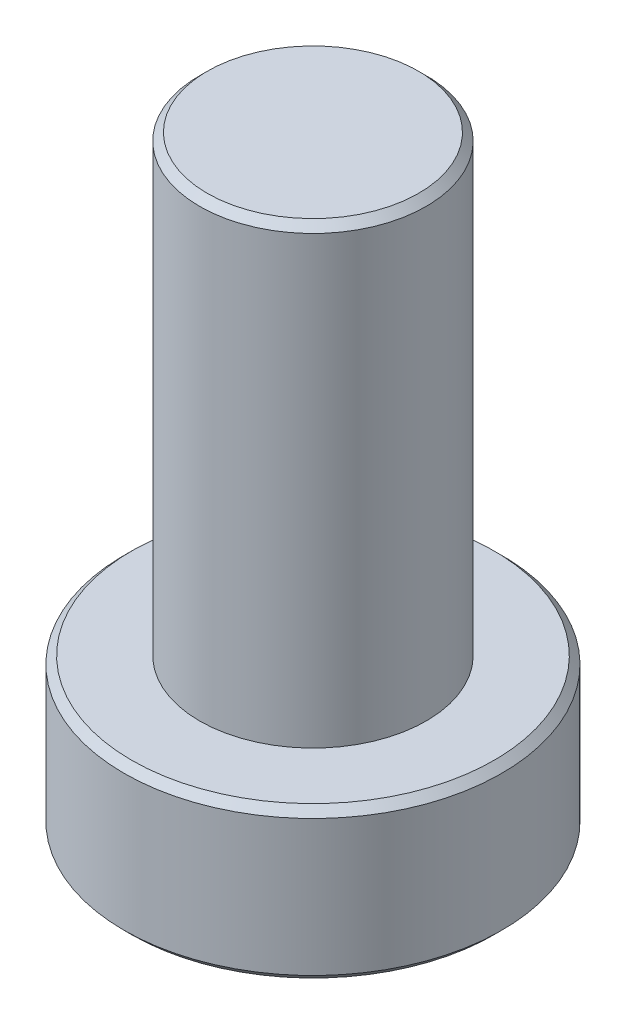
ISO-10303-21;
HEADER;
FILE_DESCRIPTION(('STEP AP214'),'2;1');
FILE_NAME('part.step','',(''),(''),'','','');
FILE_SCHEMA(('AUTOMOTIVE_DESIGN { 1 0 10303 214 1 1 1 1 }'));
ENDSEC;
DATA;
#1=APPLICATION_CONTEXT('core data for automotive mechanical design processes');
#2=APPLICATION_PROTOCOL_DEFINITION('international standard','automotive_design',2000,#1);
#3=PRODUCT_CONTEXT('',#1,'mechanical');
#4=PRODUCT('Part','Part','',(#3));
#5=PRODUCT_RELATED_PRODUCT_CATEGORY('part','',(#4));
#6=PRODUCT_DEFINITION_FORMATION('','',#4);
#7=PRODUCT_DEFINITION_CONTEXT('part definition',#1,'design');
#8=PRODUCT_DEFINITION('design','',#6,#7);
#9=PRODUCT_DEFINITION_SHAPE('','',#8);
#10=(LENGTH_UNIT() NAMED_UNIT(*) SI_UNIT(.MILLI.,.METRE.));
#11=(NAMED_UNIT(*) PLANE_ANGLE_UNIT() SI_UNIT($,.RADIAN.));
#12=(NAMED_UNIT(*) SI_UNIT($,.STERADIAN.) SOLID_ANGLE_UNIT());
#13=UNCERTAINTY_MEASURE_WITH_UNIT(LENGTH_MEASURE(1.E-05),#10,'distance_accuracy_value','');
#14=(GEOMETRIC_REPRESENTATION_CONTEXT(3) GLOBAL_UNCERTAINTY_ASSIGNED_CONTEXT((#13)) GLOBAL_UNIT_ASSIGNED_CONTEXT((#10,
#11,#12)) REPRESENTATION_CONTEXT('',''));
#15=CARTESIAN_POINT('',(0.,0.,0.));
#16=DIRECTION('',(0.,0.,1.));
#17=DIRECTION('',(1.,0.,0.));
#18=AXIS2_PLACEMENT_3D('',#15,#16,#17);
#19=CARTESIAN_POINT('',(0.,4.,0.));
#20=DIRECTION('',(0.,-1.,0.));
#21=DIRECTION('',(0.,0.,-1.));
#22=AXIS2_PLACEMENT_3D('',#19,#20,#21);
#23=CYLINDRICAL_SURFACE('',#22,5.);
#24=CARTESIAN_POINT('',(0.,0.199999999999998,0.));
#25=DIRECTION('',(0.,1.,0.));
#26=DIRECTION('',(0.,0.,1.));
#27=AXIS2_PLACEMENT_3D('',#24,#25,#26);
#28=CIRCLE('',#27,5.);
#29=CARTESIAN_POINT('',(0.,0.199999999999998,5.));
#30=VERTEX_POINT('',#29);
#31=EDGE_CURVE('E53',#30,#30,#28,.T.);
#32=ORIENTED_EDGE('',*,*,#31,.T.);
#33=EDGE_LOOP('',(#32));
#34=FACE_BOUND('',#33,.T.);
#35=CARTESIAN_POINT('',(0.,3.8,0.));
#36=DIRECTION('',(0.,1.,0.));
#37=DIRECTION('',(0.,0.,1.));
#38=AXIS2_PLACEMENT_3D('',#35,#36,#37);
#39=CIRCLE('',#38,5.);
#40=CARTESIAN_POINT('',(0.,3.8,5.));
#41=VERTEX_POINT('',#40);
#42=EDGE_CURVE('E56',#41,#41,#39,.F.);
#43=ORIENTED_EDGE('',*,*,#42,.T.);
#44=EDGE_LOOP('',(#43));
#45=FACE_BOUND('',#44,.T.);
#46=ADVANCED_FACE('F33',(#34,#45),#23,.T.);
#47=CARTESIAN_POINT('',(0.,4.,0.));
#48=DIRECTION('',(0.,1.,0.));
#49=DIRECTION('',(0.,0.,1.));
#50=AXIS2_PLACEMENT_3D('',#47,#48,#49);
#51=PLANE('',#50);
#52=CARTESIAN_POINT('',(0.,4.,0.));
#53=DIRECTION('',(0.,1.,0.));
#54=DIRECTION('',(0.,0.,1.));
#55=AXIS2_PLACEMENT_3D('',#52,#53,#54);
#56=CIRCLE('',#55,4.8);
#57=CARTESIAN_POINT('',(0.,4.,4.8));
#58=VERTEX_POINT('',#57);
#59=EDGE_CURVE('E44',#58,#58,#56,.T.);
#60=ORIENTED_EDGE('',*,*,#59,.T.);
#61=EDGE_LOOP('',(#60));
#62=FACE_BOUND('',#61,.T.);
#63=CARTESIAN_POINT('',(0.,4.,0.));
#64=DIRECTION('',(0.,1.,0.));
#65=DIRECTION('',(0.,0.,1.));
#66=AXIS2_PLACEMENT_3D('',#63,#64,#65);
#67=CIRCLE('',#66,3.);
#68=CARTESIAN_POINT('',(0.,4.,3.));
#69=VERTEX_POINT('',#68);
#70=EDGE_CURVE('E59',#69,#69,#67,.T.);
#71=ORIENTED_EDGE('',*,*,#70,.F.);
#72=EDGE_LOOP('',(#71));
#73=FACE_BOUND('',#72,.T.);
#74=ADVANCED_FACE('F65',(#62,#73),#51,.T.);
#75=CARTESIAN_POINT('',(0.,0.,0.));
#76=DIRECTION('',(0.,1.,0.));
#77=DIRECTION('',(0.,0.,1.));
#78=AXIS2_PLACEMENT_3D('',#75,#76,#77);
#79=PLANE('',#78);
#80=CARTESIAN_POINT('',(0.,0.,0.));
#81=DIRECTION('',(0.,1.,0.));
#82=DIRECTION('',(0.,0.,1.));
#83=AXIS2_PLACEMENT_3D('',#80,#81,#82);
#84=CIRCLE('',#83,4.8);
#85=CARTESIAN_POINT('',(0.,0.,4.8));
#86=VERTEX_POINT('',#85);
#87=EDGE_CURVE('E48',#86,#86,#84,.F.);
#88=ORIENTED_EDGE('',*,*,#87,.T.);
#89=EDGE_LOOP('',(#88));
#90=FACE_BOUND('',#89,.T.);
#91=ADVANCED_FACE('F67',(#90),#79,.F.);
#92=CARTESIAN_POINT('',(0.,16.,0.));
#93=DIRECTION('',(0.,-1.,0.));
#94=DIRECTION('',(0.,0.,-1.));
#95=AXIS2_PLACEMENT_3D('',#92,#93,#94);
#96=CYLINDRICAL_SURFACE('',#95,3.);
#97=CARTESIAN_POINT('',(0.,15.8,0.));
#98=DIRECTION('',(0.,1.,0.));
#99=DIRECTION('',(0.,0.,1.));
#100=AXIS2_PLACEMENT_3D('',#97,#98,#99);
#101=CIRCLE('',#100,3.);
#102=CARTESIAN_POINT('',(0.,15.8,3.));
#103=VERTEX_POINT('',#102);
#104=EDGE_CURVE('E10',#103,#103,#101,.F.);
#105=ORIENTED_EDGE('',*,*,#104,.T.);
#106=EDGE_LOOP('',(#105));
#107=FACE_BOUND('',#106,.T.);
#108=ORIENTED_EDGE('',*,*,#70,.T.);
#109=EDGE_LOOP('',(#108));
#110=FACE_BOUND('',#109,.T.);
#111=ADVANCED_FACE('F63',(#107,#110),#96,.T.);
#112=CARTESIAN_POINT('',(0.,16.,0.));
#113=DIRECTION('',(0.,1.,0.));
#114=DIRECTION('',(0.,0.,1.));
#115=AXIS2_PLACEMENT_3D('',#112,#113,#114);
#116=PLANE('',#115);
#117=CARTESIAN_POINT('',(0.,16.,0.));
#118=DIRECTION('',(0.,1.,0.));
#119=DIRECTION('',(0.,0.,1.));
#120=AXIS2_PLACEMENT_3D('',#117,#118,#119);
#121=CIRCLE('',#120,2.8);
#122=CARTESIAN_POINT('',(0.,16.,2.8));
#123=VERTEX_POINT('',#122);
#124=EDGE_CURVE('E40',#123,#123,#121,.T.);
#125=ORIENTED_EDGE('',*,*,#124,.T.);
#126=EDGE_LOOP('',(#125));
#127=FACE_BOUND('',#126,.T.);
#128=ADVANCED_FACE('F84',(#127),#116,.T.);
#129=CARTESIAN_POINT('',(0.,0.199999999999998,0.));
#130=DIRECTION('',(0.,1.,0.));
#131=DIRECTION('',(0.,0.,1.));
#132=AXIS2_PLACEMENT_3D('',#129,#130,#131);
#133=CONICAL_SURFACE('',#132,5.,0.785398163397448);
#134=ORIENTED_EDGE('',*,*,#87,.F.);
#135=EDGE_LOOP('',(#134));
#136=FACE_BOUND('',#135,.T.);
#137=ORIENTED_EDGE('',*,*,#31,.F.);
#138=EDGE_LOOP('',(#137));
#139=FACE_BOUND('',#138,.T.);
#140=ADVANCED_FACE('F81',(#136,#139),#133,.T.);
#141=CARTESIAN_POINT('',(0.,4.,0.));
#142=DIRECTION('',(0.,-1.,0.));
#143=DIRECTION('',(0.,0.,-1.));
#144=AXIS2_PLACEMENT_3D('',#141,#142,#143);
#145=CONICAL_SURFACE('',#144,4.8,0.785398163397446);
#146=ORIENTED_EDGE('',*,*,#42,.F.);
#147=EDGE_LOOP('',(#146));
#148=FACE_BOUND('',#147,.T.);
#149=ORIENTED_EDGE('',*,*,#59,.F.);
#150=EDGE_LOOP('',(#149));
#151=FACE_BOUND('',#150,.T.);
#152=ADVANCED_FACE('F83',(#148,#151),#145,.T.);
#153=CARTESIAN_POINT('',(0.,16.,0.));
#154=DIRECTION('',(0.,-1.,0.));
#155=DIRECTION('',(0.,0.,-1.));
#156=AXIS2_PLACEMENT_3D('',#153,#154,#155);
#157=CONICAL_SURFACE('',#156,2.8,0.785398163397453);
#158=ORIENTED_EDGE('',*,*,#104,.F.);
#159=EDGE_LOOP('',(#158));
#160=FACE_BOUND('',#159,.T.);
#161=ORIENTED_EDGE('',*,*,#124,.F.);
#162=EDGE_LOOP('',(#161));
#163=FACE_BOUND('',#162,.T.);
#164=ADVANCED_FACE('F35',(#160,#163),#157,.T.);
#165=CLOSED_SHELL('',(#46,#74,#91,#111,#128,#140,#152,#164));
#166=MANIFOLD_SOLID_BREP('B2',#165);
#167=ADVANCED_BREP_SHAPE_REPRESENTATION('',(#18,#166),#14);
#168=SHAPE_DEFINITION_REPRESENTATION(#9,#167);
ENDSEC;
END-ISO-10303-21;
